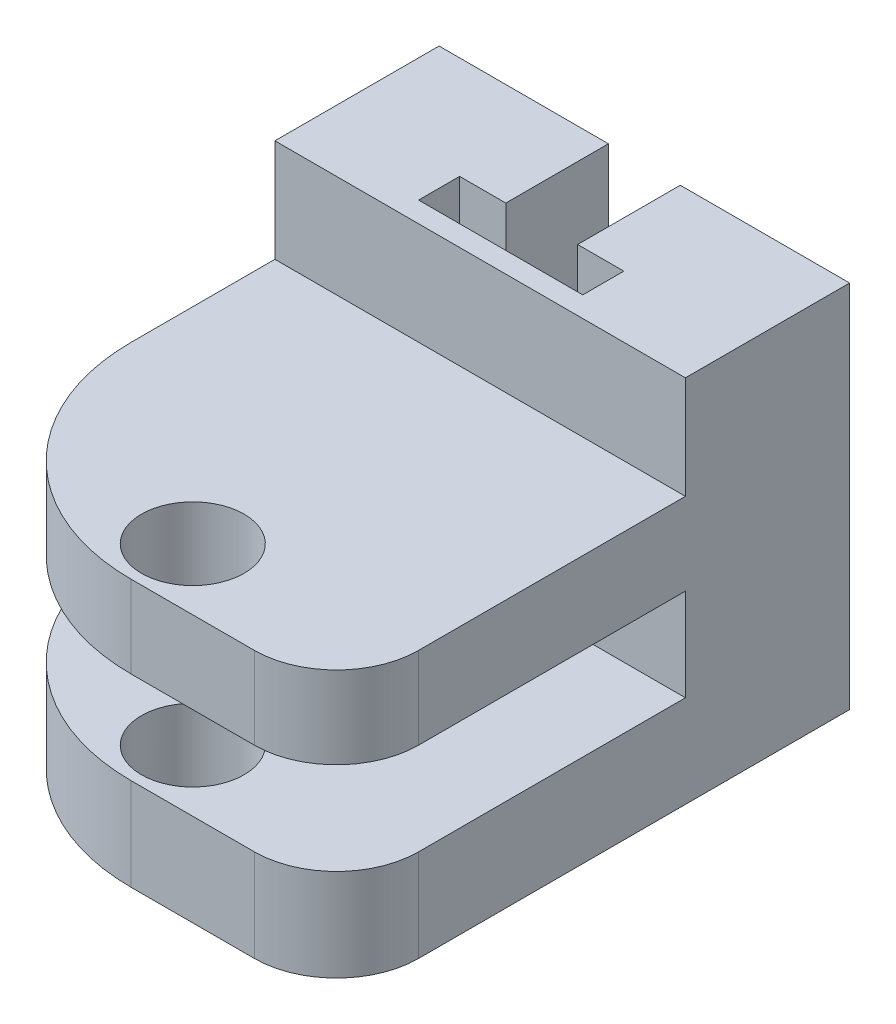
ISO-10303-21;
HEADER;
FILE_DESCRIPTION(('STEP AP214'),'2;1');
FILE_NAME('part.step','',(''),(''),'','','');
FILE_SCHEMA(('AUTOMOTIVE_DESIGN { 1 0 10303 214 1 1 1 1 }'));
ENDSEC;
DATA;
#1=APPLICATION_CONTEXT('core data for automotive mechanical design processes');
#2=APPLICATION_PROTOCOL_DEFINITION('international standard','automotive_design',2000,#1);
#3=PRODUCT_CONTEXT('',#1,'mechanical');
#4=PRODUCT('Part','Part','',(#3));
#5=PRODUCT_RELATED_PRODUCT_CATEGORY('part','',(#4));
#6=PRODUCT_DEFINITION_FORMATION('','',#4);
#7=PRODUCT_DEFINITION_CONTEXT('part definition',#1,'design');
#8=PRODUCT_DEFINITION('design','',#6,#7);
#9=PRODUCT_DEFINITION_SHAPE('','',#8);
#10=(LENGTH_UNIT() NAMED_UNIT(*) SI_UNIT(.MILLI.,.METRE.));
#11=(NAMED_UNIT(*) PLANE_ANGLE_UNIT() SI_UNIT($,.RADIAN.));
#12=(NAMED_UNIT(*) SI_UNIT($,.STERADIAN.) SOLID_ANGLE_UNIT());
#13=UNCERTAINTY_MEASURE_WITH_UNIT(LENGTH_MEASURE(1.E-05),#10,'distance_accuracy_value','');
#14=(GEOMETRIC_REPRESENTATION_CONTEXT(3) GLOBAL_UNCERTAINTY_ASSIGNED_CONTEXT((#13)) GLOBAL_UNIT_ASSIGNED_CONTEXT((#10,
#11,#12)) REPRESENTATION_CONTEXT('',''));
#15=CARTESIAN_POINT('',(0.,0.,0.));
#16=DIRECTION('',(0.,0.,1.));
#17=DIRECTION('',(1.,0.,0.));
#18=AXIS2_PLACEMENT_3D('',#15,#16,#17);
#19=CARTESIAN_POINT('',(0.247080795987481,3.,10.5748161790375));
#20=DIRECTION('',(0.,-1.,0.));
#21=DIRECTION('',(0.,0.,-1.));
#22=AXIS2_PLACEMENT_3D('',#19,#20,#21);
#23=CYLINDRICAL_SURFACE('',#22,10.);
#24=CARTESIAN_POINT('',(0.247080795987481,9.,10.5748161790375));
#25=DIRECTION('',(0.,-1.,0.));
#26=DIRECTION('',(0.,0.,-1.));
#27=AXIS2_PLACEMENT_3D('',#24,#25,#26);
#28=CIRCLE('',#27,10.);
#29=CARTESIAN_POINT('',(0.247080795987481,9.,20.5748161790375));
#30=VERTEX_POINT('',#29);
#31=CARTESIAN_POINT('',(-9.75291920401252,9.,10.5748161790375));
#32=VERTEX_POINT('',#31);
#33=EDGE_CURVE('E282',#30,#32,#28,.T.);
#34=ORIENTED_EDGE('',*,*,#33,.F.);
#35=DIRECTION('',(0.,-1.,0.));
#36=VECTOR('',#35,1.);
#37=CARTESIAN_POINT('',(0.247080795987481,3.,20.5748161790375));
#38=LINE('',#37,#36);
#39=CARTESIAN_POINT('',(0.247080795987481,13.,20.5748161790375));
#40=VERTEX_POINT('',#39);
#41=EDGE_CURVE('E414',#40,#30,#38,.T.);
#42=ORIENTED_EDGE('',*,*,#41,.F.);
#43=CARTESIAN_POINT('',(0.247080795987481,13.,10.5748161790375));
#44=DIRECTION('',(0.,-1.,0.));
#45=DIRECTION('',(0.,0.,-1.));
#46=AXIS2_PLACEMENT_3D('',#43,#44,#45);
#47=CIRCLE('',#46,10.);
#48=CARTESIAN_POINT('',(-9.75291920401252,13.,10.5748161790375));
#49=VERTEX_POINT('',#48);
#50=EDGE_CURVE('E313',#40,#49,#47,.T.);
#51=ORIENTED_EDGE('',*,*,#50,.T.);
#52=DIRECTION('',(0.,-1.,0.));
#53=VECTOR('',#52,1.);
#54=CARTESIAN_POINT('',(-9.75291920401252,3.,10.5748161790375));
#55=LINE('',#54,#53);
#56=EDGE_CURVE('E419',#49,#32,#55,.T.);
#57=ORIENTED_EDGE('',*,*,#56,.T.);
#58=EDGE_LOOP('',(#34,#42,#51,#57));
#59=FACE_BOUND('',#58,.T.);
#60=ADVANCED_FACE('F43',(#59),#23,.T.);
#61=CARTESIAN_POINT('',(0.247080795987481,3.,20.5748161790375));
#62=DIRECTION('',(0.,0.,-1.));
#63=DIRECTION('',(-1.,0.,0.));
#64=AXIS2_PLACEMENT_3D('',#61,#62,#63);
#65=PLANE('',#64);
#66=DIRECTION('',(1.,0.,0.));
#67=VECTOR('',#66,1.);
#68=CARTESIAN_POINT('',(-9.75291920401252,9.,20.5748161790375));
#69=LINE('',#68,#67);
#70=CARTESIAN_POINT('',(6.24708079598748,9.,20.5748161790375));
#71=VERTEX_POINT('',#70);
#72=EDGE_CURVE('E244',#30,#71,#69,.T.);
#73=ORIENTED_EDGE('',*,*,#72,.T.);
#74=DIRECTION('',(0.,-1.,0.));
#75=VECTOR('',#74,1.);
#76=CARTESIAN_POINT('',(6.24708079598748,3.,20.5748161790375));
#77=LINE('',#76,#75);
#78=CARTESIAN_POINT('',(6.24708079598748,13.,20.5748161790375));
#79=VERTEX_POINT('',#78);
#80=EDGE_CURVE('E434',#71,#79,#77,.F.);
#81=ORIENTED_EDGE('',*,*,#80,.T.);
#82=DIRECTION('',(-1.,0.,0.));
#83=VECTOR('',#82,1.);
#84=CARTESIAN_POINT('',(0.247080795987481,13.,20.5748161790375));
#85=LINE('',#84,#83);
#86=EDGE_CURVE('E309',#79,#40,#85,.T.);
#87=ORIENTED_EDGE('',*,*,#86,.T.);
#88=ORIENTED_EDGE('',*,*,#41,.T.);
#89=EDGE_LOOP('',(#73,#81,#87,#88));
#90=FACE_BOUND('',#89,.T.);
#91=ADVANCED_FACE('F455',(#90),#65,.F.);
#92=CARTESIAN_POINT('',(0.247080795987481,3.,17.5748161790375));
#93=DIRECTION('',(0.,-1.,0.));
#94=DIRECTION('',(0.,0.,-1.));
#95=AXIS2_PLACEMENT_3D('',#92,#93,#94);
#96=CYLINDRICAL_SURFACE('',#95,2.5);
#97=CARTESIAN_POINT('',(0.247080795987481,13.,17.5748161790375));
#98=DIRECTION('',(0.,-1.,0.));
#99=DIRECTION('',(0.,0.,-1.));
#100=AXIS2_PLACEMENT_3D('',#97,#98,#99);
#101=CIRCLE('',#100,2.5);
#102=CARTESIAN_POINT('',(0.247080795987481,13.,15.0748161790375));
#103=VERTEX_POINT('',#102);
#104=EDGE_CURVE('E293',#103,#103,#101,.T.);
#105=ORIENTED_EDGE('',*,*,#104,.F.);
#106=EDGE_LOOP('',(#105));
#107=FACE_BOUND('',#106,.T.);
#108=CARTESIAN_POINT('',(0.247080795987481,9.,17.5748161790375));
#109=DIRECTION('',(0.,-1.,0.));
#110=DIRECTION('',(0.,0.,-1.));
#111=AXIS2_PLACEMENT_3D('',#108,#109,#110);
#112=CIRCLE('',#111,2.5);
#113=CARTESIAN_POINT('',(0.247080795987481,9.,15.0748161790375));
#114=VERTEX_POINT('',#113);
#115=EDGE_CURVE('E278',#114,#114,#112,.T.);
#116=ORIENTED_EDGE('',*,*,#115,.T.);
#117=EDGE_LOOP('',(#116));
#118=FACE_BOUND('',#117,.T.);
#119=ADVANCED_FACE('F514',(#107,#118),#96,.F.);
#120=CARTESIAN_POINT('',(6.24708079598748,3.,16.5748161790375));
#121=DIRECTION('',(0.,-1.,0.));
#122=DIRECTION('',(0.,0.,-1.));
#123=AXIS2_PLACEMENT_3D('',#120,#121,#122);
#124=CYLINDRICAL_SURFACE('',#123,4.);
#125=ORIENTED_EDGE('',*,*,#80,.F.);
#126=CARTESIAN_POINT('',(6.24708079598748,9.,16.5748161790375));
#127=DIRECTION('',(0.,-1.,0.));
#128=DIRECTION('',(0.,0.,-1.));
#129=AXIS2_PLACEMENT_3D('',#126,#127,#128);
#130=CIRCLE('',#129,4.);
#131=CARTESIAN_POINT('',(10.2470807959875,9.,16.5748161790375));
#132=VERTEX_POINT('',#131);
#133=EDGE_CURVE('E52',#71,#132,#130,.F.);
#134=ORIENTED_EDGE('',*,*,#133,.T.);
#135=DIRECTION('',(0.,-1.,0.));
#136=VECTOR('',#135,1.);
#137=CARTESIAN_POINT('',(10.2470807959875,3.,16.5748161790375));
#138=LINE('',#137,#136);
#139=CARTESIAN_POINT('',(10.2470807959875,13.,16.5748161790375));
#140=VERTEX_POINT('',#139);
#141=EDGE_CURVE('E427',#140,#132,#138,.T.);
#142=ORIENTED_EDGE('',*,*,#141,.F.);
#143=CARTESIAN_POINT('',(6.24708079598748,13.,16.5748161790375));
#144=DIRECTION('',(0.,-1.,0.));
#145=DIRECTION('',(0.,0.,-1.));
#146=AXIS2_PLACEMENT_3D('',#143,#144,#145);
#147=CIRCLE('',#146,4.);
#148=EDGE_CURVE('E305',#140,#79,#147,.T.);
#149=ORIENTED_EDGE('',*,*,#148,.T.);
#150=EDGE_LOOP('',(#125,#134,#142,#149));
#151=FACE_BOUND('',#150,.T.);
#152=ADVANCED_FACE('F443',(#151),#124,.T.);
#153=CARTESIAN_POINT('',(1.99708079598748,3.,0.574816179037526));
#154=DIRECTION('',(1.,0.,0.));
#155=DIRECTION('',(0.,0.,-1.));
#156=AXIS2_PLACEMENT_3D('',#153,#154,#155);
#157=PLANE('',#156);
#158=DIRECTION('',(0.,-1.,0.));
#159=VECTOR('',#158,1.);
#160=CARTESIAN_POINT('',(1.99708079598748,3.,-4.42518382096247));
#161=LINE('',#160,#159);
#162=CARTESIAN_POINT('',(1.99708079598748,18.,-4.42518382096247));
#163=VERTEX_POINT('',#162);
#164=CARTESIAN_POINT('',(1.99708079598748,6.5,-4.42518382096247));
#165=VERTEX_POINT('',#164);
#166=EDGE_CURVE('E407',#163,#165,#161,.T.);
#167=ORIENTED_EDGE('',*,*,#166,.T.);
#168=DIRECTION('',(0.,0.,-1.));
#169=VECTOR('',#168,1.);
#170=CARTESIAN_POINT('',(1.99708079598748,6.5,0.574816179037526));
#171=LINE('',#170,#169);
#172=CARTESIAN_POINT('',(1.99708079598748,6.5,0.574816179037526));
#173=VERTEX_POINT('',#172);
#174=EDGE_CURVE('E220',#173,#165,#171,.T.);
#175=ORIENTED_EDGE('',*,*,#174,.F.);
#176=DIRECTION('',(0.,-1.,0.));
#177=VECTOR('',#176,1.);
#178=CARTESIAN_POINT('',(1.99708079598748,3.,0.574816179037526));
#179=LINE('',#178,#177);
#180=CARTESIAN_POINT('',(1.99708079598748,18.,0.574816179037526));
#181=VERTEX_POINT('',#180);
#182=EDGE_CURVE('E404',#181,#173,#179,.T.);
#183=ORIENTED_EDGE('',*,*,#182,.F.);
#184=DIRECTION('',(0.,0.,1.));
#185=VECTOR('',#184,1.);
#186=CARTESIAN_POINT('',(1.99708079598748,18.,-4.42518382096247));
#187=LINE('',#186,#185);
#188=EDGE_CURVE('E332',#163,#181,#187,.T.);
#189=ORIENTED_EDGE('',*,*,#188,.F.);
#190=EDGE_LOOP('',(#167,#175,#183,#189));
#191=FACE_BOUND('',#190,.T.);
#192=ADVANCED_FACE('F582',(#191),#157,.F.);
#193=CARTESIAN_POINT('',(4.24708079598748,3.,0.574816179037526));
#194=DIRECTION('',(0.,0.,-1.));
#195=DIRECTION('',(-1.,0.,0.));
#196=AXIS2_PLACEMENT_3D('',#193,#194,#195);
#197=PLANE('',#196);
#198=ORIENTED_EDGE('',*,*,#182,.T.);
#199=DIRECTION('',(-1.,0.,0.));
#200=VECTOR('',#199,1.);
#201=CARTESIAN_POINT('',(4.24708079598748,6.5,0.574816179037526));
#202=LINE('',#201,#200);
#203=CARTESIAN_POINT('',(4.24708079598748,6.5,0.574816179037526));
#204=VERTEX_POINT('',#203);
#205=EDGE_CURVE('E238',#204,#173,#202,.T.);
#206=ORIENTED_EDGE('',*,*,#205,.F.);
#207=DIRECTION('',(0.,-1.,0.));
#208=VECTOR('',#207,1.);
#209=CARTESIAN_POINT('',(4.24708079598748,3.,0.574816179037526));
#210=LINE('',#209,#208);
#211=CARTESIAN_POINT('',(4.24708079598748,18.,0.574816179037526));
#212=VERTEX_POINT('',#211);
#213=EDGE_CURVE('E401',#212,#204,#210,.T.);
#214=ORIENTED_EDGE('',*,*,#213,.F.);
#215=DIRECTION('',(1.,0.,0.));
#216=VECTOR('',#215,1.);
#217=CARTESIAN_POINT('',(1.99708079598748,18.,0.574816179037526));
#218=LINE('',#217,#216);
#219=EDGE_CURVE('E336',#181,#212,#218,.T.);
#220=ORIENTED_EDGE('',*,*,#219,.F.);
#221=EDGE_LOOP('',(#198,#206,#214,#220));
#222=FACE_BOUND('',#221,.T.);
#223=ADVANCED_FACE('F590',(#222),#197,.F.);
#224=CARTESIAN_POINT('',(4.24708079598748,3.,2.57481617903753));
#225=DIRECTION('',(1.,0.,0.));
#226=DIRECTION('',(0.,0.,-1.));
#227=AXIS2_PLACEMENT_3D('',#224,#225,#226);
#228=PLANE('',#227);
#229=ORIENTED_EDGE('',*,*,#213,.T.);
#230=DIRECTION('',(0.,0.,-1.));
#231=VECTOR('',#230,1.);
#232=CARTESIAN_POINT('',(4.24708079598748,6.5,2.57481617903753));
#233=LINE('',#232,#231);
#234=CARTESIAN_POINT('',(4.24708079598748,6.5,2.57481617903753));
#235=VERTEX_POINT('',#234);
#236=EDGE_CURVE('E234',#235,#204,#233,.T.);
#237=ORIENTED_EDGE('',*,*,#236,.F.);
#238=DIRECTION('',(0.,-1.,0.));
#239=VECTOR('',#238,1.);
#240=CARTESIAN_POINT('',(4.24708079598748,3.,2.57481617903753));
#241=LINE('',#240,#239);
#242=CARTESIAN_POINT('',(4.24708079598748,18.,2.57481617903753));
#243=VERTEX_POINT('',#242);
#244=EDGE_CURVE('E398',#243,#235,#241,.T.);
#245=ORIENTED_EDGE('',*,*,#244,.F.);
#246=DIRECTION('',(0.,0.,1.));
#247=VECTOR('',#246,1.);
#248=CARTESIAN_POINT('',(4.24708079598748,18.,0.574816179037526));
#249=LINE('',#248,#247);
#250=EDGE_CURVE('E340',#212,#243,#249,.T.);
#251=ORIENTED_EDGE('',*,*,#250,.F.);
#252=EDGE_LOOP('',(#229,#237,#245,#251));
#253=FACE_BOUND('',#252,.T.);
#254=ADVANCED_FACE('F599',(#253),#228,.F.);
#255=CARTESIAN_POINT('',(-3.75291920401252,3.,2.57481617903753));
#256=DIRECTION('',(0.,0.,1.));
#257=DIRECTION('',(1.,0.,0.));
#258=AXIS2_PLACEMENT_3D('',#255,#256,#257);
#259=PLANE('',#258);
#260=ORIENTED_EDGE('',*,*,#244,.T.);
#261=DIRECTION('',(1.,0.,0.));
#262=VECTOR('',#261,1.);
#263=CARTESIAN_POINT('',(-3.75291920401252,6.5,2.57481617903753));
#264=LINE('',#263,#262);
#265=CARTESIAN_POINT('',(-3.75291920401252,6.5,2.57481617903753));
#266=VERTEX_POINT('',#265);
#267=EDGE_CURVE('E230',#266,#235,#264,.T.);
#268=ORIENTED_EDGE('',*,*,#267,.F.);
#269=DIRECTION('',(0.,-1.,0.));
#270=VECTOR('',#269,1.);
#271=CARTESIAN_POINT('',(-3.75291920401252,3.,2.57481617903753));
#272=LINE('',#271,#270);
#273=CARTESIAN_POINT('',(-3.75291920401252,18.,2.57481617903753));
#274=VERTEX_POINT('',#273);
#275=EDGE_CURVE('E395',#274,#266,#272,.T.);
#276=ORIENTED_EDGE('',*,*,#275,.F.);
#277=DIRECTION('',(-1.,0.,0.));
#278=VECTOR('',#277,1.);
#279=CARTESIAN_POINT('',(4.24708079598748,18.,2.57481617903753));
#280=LINE('',#279,#278);
#281=EDGE_CURVE('E344',#243,#274,#280,.T.);
#282=ORIENTED_EDGE('',*,*,#281,.F.);
#283=EDGE_LOOP('',(#260,#268,#276,#282));
#284=FACE_BOUND('',#283,.T.);
#285=ADVANCED_FACE('F607',(#284),#259,.F.);
#286=CARTESIAN_POINT('',(-3.75291920401252,3.,0.574816179037526));
#287=DIRECTION('',(-1.,0.,0.));
#288=DIRECTION('',(0.,0.,1.));
#289=AXIS2_PLACEMENT_3D('',#286,#287,#288);
#290=PLANE('',#289);
#291=ORIENTED_EDGE('',*,*,#275,.T.);
#292=DIRECTION('',(0.,0.,1.));
#293=VECTOR('',#292,1.);
#294=CARTESIAN_POINT('',(-3.75291920401252,6.5,0.574816179037526));
#295=LINE('',#294,#293);
#296=CARTESIAN_POINT('',(-3.75291920401252,6.5,0.574816179037526));
#297=VERTEX_POINT('',#296);
#298=EDGE_CURVE('E226',#297,#266,#295,.T.);
#299=ORIENTED_EDGE('',*,*,#298,.F.);
#300=DIRECTION('',(0.,-1.,0.));
#301=VECTOR('',#300,1.);
#302=CARTESIAN_POINT('',(-3.75291920401252,3.,0.574816179037526));
#303=LINE('',#302,#301);
#304=CARTESIAN_POINT('',(-3.75291920401252,18.,0.574816179037526));
#305=VERTEX_POINT('',#304);
#306=EDGE_CURVE('E392',#305,#297,#303,.T.);
#307=ORIENTED_EDGE('',*,*,#306,.F.);
#308=DIRECTION('',(0.,0.,-1.));
#309=VECTOR('',#308,1.);
#310=CARTESIAN_POINT('',(-3.75291920401252,18.,2.57481617903753));
#311=LINE('',#310,#309);
#312=EDGE_CURVE('E348',#274,#305,#311,.T.);
#313=ORIENTED_EDGE('',*,*,#312,.F.);
#314=EDGE_LOOP('',(#291,#299,#307,#313));
#315=FACE_BOUND('',#314,.T.);
#316=ADVANCED_FACE('F615',(#315),#290,.F.);
#317=CARTESIAN_POINT('',(-1.50291920401252,3.,0.574816179037526));
#318=DIRECTION('',(0.,0.,-1.));
#319=DIRECTION('',(-1.,0.,0.));
#320=AXIS2_PLACEMENT_3D('',#317,#318,#319);
#321=PLANE('',#320);
#322=ORIENTED_EDGE('',*,*,#306,.T.);
#323=DIRECTION('',(-1.,0.,0.));
#324=VECTOR('',#323,1.);
#325=CARTESIAN_POINT('',(-1.50291920401252,6.5,0.574816179037527));
#326=LINE('',#325,#324);
#327=CARTESIAN_POINT('',(-1.50291920401252,6.5,0.574816179037527));
#328=VERTEX_POINT('',#327);
#329=EDGE_CURVE('E214',#328,#297,#326,.T.);
#330=ORIENTED_EDGE('',*,*,#329,.F.);
#331=DIRECTION('',(0.,-1.,0.));
#332=VECTOR('',#331,1.);
#333=CARTESIAN_POINT('',(-1.50291920401252,3.,0.574816179037526));
#334=LINE('',#333,#332);
#335=CARTESIAN_POINT('',(-1.50291920401252,18.,0.574816179037526));
#336=VERTEX_POINT('',#335);
#337=EDGE_CURVE('E204',#336,#328,#334,.T.);
#338=ORIENTED_EDGE('',*,*,#337,.F.);
#339=DIRECTION('',(1.,0.,0.));
#340=VECTOR('',#339,1.);
#341=CARTESIAN_POINT('',(-3.75291920401252,18.,0.574816179037526));
#342=LINE('',#341,#340);
#343=EDGE_CURVE('E352',#305,#336,#342,.T.);
#344=ORIENTED_EDGE('',*,*,#343,.F.);
#345=EDGE_LOOP('',(#322,#330,#338,#344));
#346=FACE_BOUND('',#345,.T.);
#347=ADVANCED_FACE('F504',(#346),#321,.F.);
#348=CARTESIAN_POINT('',(-1.50291920401252,3.,-4.42518382096247));
#349=DIRECTION('',(-1.,0.,0.));
#350=DIRECTION('',(0.,0.,1.));
#351=AXIS2_PLACEMENT_3D('',#348,#349,#350);
#352=PLANE('',#351);
#353=ORIENTED_EDGE('',*,*,#337,.T.);
#354=DIRECTION('',(0.,0.,1.));
#355=VECTOR('',#354,1.);
#356=CARTESIAN_POINT('',(-1.50291920401252,6.5,-4.42518382096247));
#357=LINE('',#356,#355);
#358=CARTESIAN_POINT('',(-1.50291920401252,6.5,-4.42518382096247));
#359=VERTEX_POINT('',#358);
#360=EDGE_CURVE('E208',#359,#328,#357,.T.);
#361=ORIENTED_EDGE('',*,*,#360,.F.);
#362=DIRECTION('',(0.,-1.,0.));
#363=VECTOR('',#362,1.);
#364=CARTESIAN_POINT('',(-1.50291920401252,3.,-4.42518382096247));
#365=LINE('',#364,#363);
#366=CARTESIAN_POINT('',(-1.50291920401252,18.,-4.42518382096247));
#367=VERTEX_POINT('',#366);
#368=EDGE_CURVE('E193',#367,#359,#365,.T.);
#369=ORIENTED_EDGE('',*,*,#368,.F.);
#370=DIRECTION('',(0.,0.,-1.));
#371=VECTOR('',#370,1.);
#372=CARTESIAN_POINT('',(-1.50291920401252,18.,0.574816179037526));
#373=LINE('',#372,#371);
#374=EDGE_CURVE('E356',#336,#367,#373,.T.);
#375=ORIENTED_EDGE('',*,*,#374,.F.);
#376=EDGE_LOOP('',(#353,#361,#369,#375));
#377=FACE_BOUND('',#376,.T.);
#378=ADVANCED_FACE('F209',(#377),#352,.F.);
#379=CARTESIAN_POINT('',(-9.75291920401252,18.,3.57481617903752));
#380=DIRECTION('',(0.,0.,-1.));
#381=DIRECTION('',(-1.,0.,0.));
#382=AXIS2_PLACEMENT_3D('',#379,#380,#381);
#383=PLANE('',#382);
#384=DIRECTION('',(-1.,0.,0.));
#385=VECTOR('',#384,1.);
#386=CARTESIAN_POINT('',(-9.75291920401252,13.,3.57481617903752));
#387=LINE('',#386,#385);
#388=CARTESIAN_POINT('',(10.2470807959875,13.,3.57481617903752));
#389=VERTEX_POINT('',#388);
#390=CARTESIAN_POINT('',(-9.75291920401252,13.,3.57481617903752));
#391=VERTEX_POINT('',#390);
#392=EDGE_CURVE('E67',#389,#391,#387,.T.);
#393=ORIENTED_EDGE('',*,*,#392,.F.);
#394=DIRECTION('',(0.,-1.,0.));
#395=VECTOR('',#394,1.);
#396=CARTESIAN_POINT('',(10.2470807959875,18.,3.57481617903752));
#397=LINE('',#396,#395);
#398=CARTESIAN_POINT('',(10.2470807959875,18.,3.57481617903752));
#399=VERTEX_POINT('',#398);
#400=EDGE_CURVE('E361',#399,#389,#397,.T.);
#401=ORIENTED_EDGE('',*,*,#400,.F.);
#402=DIRECTION('',(1.,0.,0.));
#403=VECTOR('',#402,1.);
#404=CARTESIAN_POINT('',(-9.75291920401252,18.,3.57481617903752));
#405=LINE('',#404,#403);
#406=CARTESIAN_POINT('',(-9.75291920401252,18.,3.57481617903752));
#407=VERTEX_POINT('',#406);
#408=EDGE_CURVE('E321',#407,#399,#405,.T.);
#409=ORIENTED_EDGE('',*,*,#408,.F.);
#410=DIRECTION('',(0.,-1.,0.));
#411=VECTOR('',#410,1.);
#412=CARTESIAN_POINT('',(-9.75291920401252,18.,3.57481617903752));
#413=LINE('',#412,#411);
#414=EDGE_CURVE('E364',#407,#391,#413,.T.);
#415=ORIENTED_EDGE('',*,*,#414,.T.);
#416=EDGE_LOOP('',(#393,#401,#409,#415));
#417=FACE_BOUND('',#416,.T.);
#418=ADVANCED_FACE('F496',(#417),#383,.F.);
#419=CARTESIAN_POINT('',(0.247080795987481,0.,10.5748161790375));
#420=DIRECTION('',(0.,1.,0.));
#421=DIRECTION('',(0.,0.,1.));
#422=AXIS2_PLACEMENT_3D('',#419,#420,#421);
#423=PLANE('',#422);
#424=DIRECTION('',(0.,0.,1.));
#425=VECTOR('',#424,1.);
#426=CARTESIAN_POINT('',(-9.75291920401252,0.,10.5748161790375));
#427=LINE('',#426,#425);
#428=CARTESIAN_POINT('',(-9.75291920401252,0.,-4.42518382096247));
#429=VERTEX_POINT('',#428);
#430=CARTESIAN_POINT('',(-9.75291920401252,0.,10.5748161790375));
#431=VERTEX_POINT('',#430);
#432=EDGE_CURVE('E371',#429,#431,#427,.T.);
#433=ORIENTED_EDGE('',*,*,#432,.F.);
#434=DIRECTION('',(-1.,0.,0.));
#435=VECTOR('',#434,1.);
#436=CARTESIAN_POINT('',(1.99708079598748,0.,-4.42518382096247));
#437=LINE('',#436,#435);
#438=CARTESIAN_POINT('',(10.2470807959875,0.,-4.42518382096247));
#439=VERTEX_POINT('',#438);
#440=EDGE_CURVE('E205',#439,#429,#437,.T.);
#441=ORIENTED_EDGE('',*,*,#440,.F.);
#442=DIRECTION('',(0.,0.,-1.));
#443=VECTOR('',#442,1.);
#444=CARTESIAN_POINT('',(10.2470807959875,0.,-4.42518382096247));
#445=LINE('',#444,#443);
#446=CARTESIAN_POINT('',(10.2470807959875,0.,16.5748161790375));
#447=VERTEX_POINT('',#446);
#448=EDGE_CURVE('E383',#447,#439,#445,.T.);
#449=ORIENTED_EDGE('',*,*,#448,.F.);
#450=CARTESIAN_POINT('',(6.24708079598748,0.,16.5748161790375));
#451=DIRECTION('',(0.,1.,0.));
#452=DIRECTION('',(0.,0.,1.));
#453=AXIS2_PLACEMENT_3D('',#450,#451,#452);
#454=CIRCLE('',#453,4.);
#455=CARTESIAN_POINT('',(6.24708079598748,0.,20.5748161790375));
#456=VERTEX_POINT('',#455);
#457=EDGE_CURVE('E431',#447,#456,#454,.F.);
#458=ORIENTED_EDGE('',*,*,#457,.T.);
#459=DIRECTION('',(1.,0.,0.));
#460=VECTOR('',#459,1.);
#461=CARTESIAN_POINT('',(0.247080795987481,0.,20.5748161790375));
#462=LINE('',#461,#460);
#463=CARTESIAN_POINT('',(0.247080795987481,0.,20.5748161790375));
#464=VERTEX_POINT('',#463);
#465=EDGE_CURVE('E379',#464,#456,#462,.T.);
#466=ORIENTED_EDGE('',*,*,#465,.F.);
#467=CARTESIAN_POINT('',(0.247080795987481,0.,10.5748161790375));
#468=DIRECTION('',(0.,1.,0.));
#469=DIRECTION('',(0.,0.,1.));
#470=AXIS2_PLACEMENT_3D('',#467,#468,#469);
#471=CIRCLE('',#470,10.);
#472=EDGE_CURVE('E375',#431,#464,#471,.T.);
#473=ORIENTED_EDGE('',*,*,#472,.F.);
#474=EDGE_LOOP('',(#433,#441,#449,#458,#466,#473));
#475=FACE_BOUND('',#474,.T.);
#476=CARTESIAN_POINT('',(0.247080795987481,0.,17.5748161790375));
#477=DIRECTION('',(0.,1.,0.));
#478=DIRECTION('',(0.,0.,1.));
#479=AXIS2_PLACEMENT_3D('',#476,#477,#478);
#480=CIRCLE('',#479,2.5);
#481=CARTESIAN_POINT('',(0.247080795987481,0.,20.0748161790375));
#482=VERTEX_POINT('',#481);
#483=EDGE_CURVE('E367',#482,#482,#480,.T.);
#484=ORIENTED_EDGE('',*,*,#483,.T.);
#485=EDGE_LOOP('',(#484));
#486=FACE_BOUND('',#485,.T.);
#487=ADVANCED_FACE('F472',(#475,#486),#423,.F.);
#488=CARTESIAN_POINT('',(-9.75291920401252,3.,10.5748161790375));
#489=DIRECTION('',(1.,0.,0.));
#490=DIRECTION('',(0.,0.,-1.));
#491=AXIS2_PLACEMENT_3D('',#488,#489,#490);
#492=PLANE('',#491);
#493=CARTESIAN_POINT('',(-9.75291920401252,4.5,10.5748161790375));
#494=VERTEX_POINT('',#493);
#495=EDGE_CURVE('E418',#494,#431,#55,.T.);
#496=ORIENTED_EDGE('',*,*,#495,.F.);
#497=DIRECTION('',(0.,0.,1.));
#498=VECTOR('',#497,1.);
#499=CARTESIAN_POINT('',(-9.75291920401252,4.5,-16.9251838209625));
#500=LINE('',#499,#498);
#501=CARTESIAN_POINT('',(-9.75291920401252,4.5,3.57481617903752));
#502=VERTEX_POINT('',#501);
#503=EDGE_CURVE('E262',#502,#494,#500,.T.);
#504=ORIENTED_EDGE('',*,*,#503,.F.);
#505=DIRECTION('',(0.,-1.,0.));
#506=VECTOR('',#505,1.);
#507=CARTESIAN_POINT('',(-9.75291920401252,9.,3.57481617903752));
#508=LINE('',#507,#506);
#509=CARTESIAN_POINT('',(-9.75291920401252,9.,3.57481617903752));
#510=VERTEX_POINT('',#509);
#511=EDGE_CURVE('E248',#510,#502,#508,.T.);
#512=ORIENTED_EDGE('',*,*,#511,.F.);
#513=DIRECTION('',(0.,0.,1.));
#514=VECTOR('',#513,1.);
#515=CARTESIAN_POINT('',(-9.75291920401252,9.,-16.9251838209625));
#516=LINE('',#515,#514);
#517=EDGE_CURVE('E249',#510,#32,#516,.T.);
#518=ORIENTED_EDGE('',*,*,#517,.T.);
#519=ORIENTED_EDGE('',*,*,#56,.F.);
#520=DIRECTION('',(0.,0.,-1.));
#521=VECTOR('',#520,1.);
#522=CARTESIAN_POINT('',(-9.75291920401252,13.,-4.42518382096247));
#523=LINE('',#522,#521);
#524=EDGE_CURVE('E297',#49,#391,#523,.T.);
#525=ORIENTED_EDGE('',*,*,#524,.T.);
#526=ORIENTED_EDGE('',*,*,#414,.F.);
#527=DIRECTION('',(0.,0.,1.));
#528=VECTOR('',#527,1.);
#529=CARTESIAN_POINT('',(-9.75291920401252,18.,-4.42518382096247));
#530=LINE('',#529,#528);
#531=CARTESIAN_POINT('',(-9.75291920401252,18.,-4.42518382096247));
#532=VERTEX_POINT('',#531);
#533=EDGE_CURVE('E317',#532,#407,#530,.T.);
#534=ORIENTED_EDGE('',*,*,#533,.F.);
#535=DIRECTION('',(0.,-1.,0.));
#536=VECTOR('',#535,1.);
#537=CARTESIAN_POINT('',(-9.75291920401252,3.,-4.42518382096247));
#538=LINE('',#537,#536);
#539=EDGE_CURVE('E423',#532,#429,#538,.T.);
#540=ORIENTED_EDGE('',*,*,#539,.T.);
#541=ORIENTED_EDGE('',*,*,#432,.T.);
#542=EDGE_LOOP('',(#496,#504,#512,#518,#519,#525,#526,#534,#540,#541));
#543=FACE_BOUND('',#542,.T.);
#544=ADVANCED_FACE('F489',(#543),#492,.F.);
#545=CARTESIAN_POINT('',(0.247080795987481,4.5,20.5748161790375));
#546=VERTEX_POINT('',#545);
#547=EDGE_CURVE('E413',#546,#464,#38,.T.);
#548=ORIENTED_EDGE('',*,*,#547,.F.);
#549=CARTESIAN_POINT('',(0.247080795987481,4.5,10.5748161790375));
#550=DIRECTION('',(0.,-1.,0.));
#551=DIRECTION('',(1.,0.,0.));
#552=AXIS2_PLACEMENT_3D('',#549,#550,#551);
#553=CIRCLE('',#552,10.);
#554=EDGE_CURVE('E289',#546,#494,#553,.T.);
#555=ORIENTED_EDGE('',*,*,#554,.T.);
#556=ORIENTED_EDGE('',*,*,#495,.T.);
#557=ORIENTED_EDGE('',*,*,#472,.T.);
#558=EDGE_LOOP('',(#548,#555,#556,#557));
#559=FACE_BOUND('',#558,.T.);
#560=ADVANCED_FACE('F468',(#559),#23,.T.);
#561=CARTESIAN_POINT('',(6.24708079598748,4.5,20.5748161790375));
#562=VERTEX_POINT('',#561);
#563=EDGE_CURVE('E435',#456,#562,#77,.F.);
#564=ORIENTED_EDGE('',*,*,#563,.T.);
#565=DIRECTION('',(1.,0.,0.));
#566=VECTOR('',#565,1.);
#567=CARTESIAN_POINT('',(-9.75291920401252,4.5,20.5748161790375));
#568=LINE('',#567,#566);
#569=EDGE_CURVE('E250',#546,#562,#568,.T.);
#570=ORIENTED_EDGE('',*,*,#569,.F.);
#571=ORIENTED_EDGE('',*,*,#547,.T.);
#572=ORIENTED_EDGE('',*,*,#465,.T.);
#573=EDGE_LOOP('',(#564,#570,#571,#572));
#574=FACE_BOUND('',#573,.T.);
#575=ADVANCED_FACE('F463',(#574),#65,.F.);
#576=CARTESIAN_POINT('',(10.2470807959875,3.,-4.42518382096247));
#577=DIRECTION('',(-1.,0.,0.));
#578=DIRECTION('',(0.,0.,1.));
#579=AXIS2_PLACEMENT_3D('',#576,#577,#578);
#580=PLANE('',#579);
#581=DIRECTION('',(0.,-1.,0.));
#582=VECTOR('',#581,1.);
#583=CARTESIAN_POINT('',(10.2470807959875,9.,3.57481617903752));
#584=LINE('',#583,#582);
#585=CARTESIAN_POINT('',(10.2470807959875,9.,3.57481617903752));
#586=VERTEX_POINT('',#585);
#587=CARTESIAN_POINT('',(10.2470807959875,4.5,3.57481617903752));
#588=VERTEX_POINT('',#587);
#589=EDGE_CURVE('E254',#586,#588,#584,.T.);
#590=ORIENTED_EDGE('',*,*,#589,.T.);
#591=DIRECTION('',(0.,0.,1.));
#592=VECTOR('',#591,1.);
#593=CARTESIAN_POINT('',(10.2470807959875,4.5,-16.9251838209625));
#594=LINE('',#593,#592);
#595=CARTESIAN_POINT('',(10.2470807959875,4.5,16.5748161790375));
#596=VERTEX_POINT('',#595);
#597=EDGE_CURVE('E258',#588,#596,#594,.T.);
#598=ORIENTED_EDGE('',*,*,#597,.T.);
#599=EDGE_CURVE('E426',#596,#447,#138,.T.);
#600=ORIENTED_EDGE('',*,*,#599,.T.);
#601=ORIENTED_EDGE('',*,*,#448,.T.);
#602=DIRECTION('',(0.,-1.,0.));
#603=VECTOR('',#602,1.);
#604=CARTESIAN_POINT('',(10.2470807959875,3.,-4.42518382096247));
#605=LINE('',#604,#603);
#606=CARTESIAN_POINT('',(10.2470807959875,18.,-4.42518382096247));
#607=VERTEX_POINT('',#606);
#608=EDGE_CURVE('E410',#607,#439,#605,.T.);
#609=ORIENTED_EDGE('',*,*,#608,.F.);
#610=DIRECTION('',(0.,0.,-1.));
#611=VECTOR('',#610,1.);
#612=CARTESIAN_POINT('',(10.2470807959875,18.,3.57481617903752));
#613=LINE('',#612,#611);
#614=EDGE_CURVE('E324',#399,#607,#613,.T.);
#615=ORIENTED_EDGE('',*,*,#614,.F.);
#616=ORIENTED_EDGE('',*,*,#400,.T.);
#617=DIRECTION('',(0.,0.,1.));
#618=VECTOR('',#617,1.);
#619=CARTESIAN_POINT('',(10.2470807959875,13.,-4.42518382096247));
#620=LINE('',#619,#618);
#621=EDGE_CURVE('E301',#389,#140,#620,.T.);
#622=ORIENTED_EDGE('',*,*,#621,.T.);
#623=ORIENTED_EDGE('',*,*,#141,.T.);
#624=DIRECTION('',(0.,0.,1.));
#625=VECTOR('',#624,1.);
#626=CARTESIAN_POINT('',(10.2470807959875,9.,-16.9251838209625));
#627=LINE('',#626,#625);
#628=EDGE_CURVE('E59',#586,#132,#627,.T.);
#629=ORIENTED_EDGE('',*,*,#628,.F.);
#630=EDGE_LOOP('',(#590,#598,#600,#601,#609,#615,#616,#622,#623,#629));
#631=FACE_BOUND('',#630,.T.);
#632=ADVANCED_FACE('F445',(#631),#580,.F.);
#633=CARTESIAN_POINT('',(1.99708079598748,3.,-4.42518382096247));
#634=DIRECTION('',(0.,0.,1.));
#635=DIRECTION('',(1.,0.,0.));
#636=AXIS2_PLACEMENT_3D('',#633,#634,#635);
#637=PLANE('',#636);
#638=DIRECTION('',(-1.,0.,0.));
#639=VECTOR('',#638,1.);
#640=CARTESIAN_POINT('',(1.99708079598748,6.5,-4.42518382096247));
#641=LINE('',#640,#639);
#642=EDGE_CURVE('E197',#165,#359,#641,.T.);
#643=ORIENTED_EDGE('',*,*,#642,.F.);
#644=ORIENTED_EDGE('',*,*,#166,.F.);
#645=DIRECTION('',(-1.,0.,0.));
#646=VECTOR('',#645,1.);
#647=CARTESIAN_POINT('',(10.2470807959875,18.,-4.42518382096247));
#648=LINE('',#647,#646);
#649=EDGE_CURVE('E328',#607,#163,#648,.T.);
#650=ORIENTED_EDGE('',*,*,#649,.F.);
#651=ORIENTED_EDGE('',*,*,#608,.T.);
#652=ORIENTED_EDGE('',*,*,#440,.T.);
#653=ORIENTED_EDGE('',*,*,#539,.F.);
#654=DIRECTION('',(-1.,0.,0.));
#655=VECTOR('',#654,1.);
#656=CARTESIAN_POINT('',(-1.50291920401252,18.,-4.42518382096247));
#657=LINE('',#656,#655);
#658=EDGE_CURVE('E199',#367,#532,#657,.T.);
#659=ORIENTED_EDGE('',*,*,#658,.F.);
#660=ORIENTED_EDGE('',*,*,#368,.T.);
#661=EDGE_LOOP('',(#643,#644,#650,#651,#652,#653,#659,#660));
#662=FACE_BOUND('',#661,.T.);
#663=ADVANCED_FACE('F195',(#662),#637,.F.);
#664=CARTESIAN_POINT('',(0.247080795987481,4.5,17.5748161790375));
#665=DIRECTION('',(0.,-1.,0.));
#666=DIRECTION('',(1.,0.,0.));
#667=AXIS2_PLACEMENT_3D('',#664,#665,#666);
#668=CIRCLE('',#667,2.5);
#669=CARTESIAN_POINT('',(2.74708079598748,4.5,17.5748161790375));
#670=VERTEX_POINT('',#669);
#671=EDGE_CURVE('E285',#670,#670,#668,.T.);
#672=ORIENTED_EDGE('',*,*,#671,.F.);
#673=EDGE_LOOP('',(#672));
#674=FACE_BOUND('',#673,.T.);
#675=ORIENTED_EDGE('',*,*,#483,.F.);
#676=EDGE_LOOP('',(#675));
#677=FACE_BOUND('',#676,.T.);
#678=ADVANCED_FACE('F575',(#674,#677),#96,.F.);
#679=CARTESIAN_POINT('',(6.24708079598748,4.5,16.5748161790375));
#680=DIRECTION('',(0.,-1.,0.));
#681=DIRECTION('',(1.,0.,0.));
#682=AXIS2_PLACEMENT_3D('',#679,#680,#681);
#683=CIRCLE('',#682,4.);
#684=EDGE_CURVE('E11',#562,#596,#683,.F.);
#685=ORIENTED_EDGE('',*,*,#684,.F.);
#686=ORIENTED_EDGE('',*,*,#563,.F.);
#687=ORIENTED_EDGE('',*,*,#457,.F.);
#688=ORIENTED_EDGE('',*,*,#599,.F.);
#689=EDGE_LOOP('',(#685,#686,#687,#688));
#690=FACE_BOUND('',#689,.T.);
#691=ADVANCED_FACE('F45',(#690),#124,.T.);
#692=CARTESIAN_POINT('',(0.,18.,0.));
#693=DIRECTION('',(0.,1.,0.));
#694=DIRECTION('',(0.,0.,1.));
#695=AXIS2_PLACEMENT_3D('',#692,#693,#694);
#696=PLANE('',#695);
#697=ORIENTED_EDGE('',*,*,#533,.T.);
#698=ORIENTED_EDGE('',*,*,#408,.T.);
#699=ORIENTED_EDGE('',*,*,#614,.T.);
#700=ORIENTED_EDGE('',*,*,#649,.T.);
#701=ORIENTED_EDGE('',*,*,#188,.T.);
#702=ORIENTED_EDGE('',*,*,#219,.T.);
#703=ORIENTED_EDGE('',*,*,#250,.T.);
#704=ORIENTED_EDGE('',*,*,#281,.T.);
#705=ORIENTED_EDGE('',*,*,#312,.T.);
#706=ORIENTED_EDGE('',*,*,#343,.T.);
#707=ORIENTED_EDGE('',*,*,#374,.T.);
#708=ORIENTED_EDGE('',*,*,#658,.T.);
#709=EDGE_LOOP('',(#697,#698,#699,#700,#701,#702,#703,#704,#705,#706,#707,#708));
#710=FACE_BOUND('',#709,.T.);
#711=ADVANCED_FACE('F493',(#710),#696,.T.);
#712=CARTESIAN_POINT('',(0.247080795987481,13.,10.5748161790375));
#713=DIRECTION('',(0.,-1.,0.));
#714=DIRECTION('',(0.,0.,-1.));
#715=AXIS2_PLACEMENT_3D('',#712,#713,#714);
#716=PLANE('',#715);
#717=ORIENTED_EDGE('',*,*,#104,.T.);
#718=EDGE_LOOP('',(#717));
#719=FACE_BOUND('',#718,.T.);
#720=ORIENTED_EDGE('',*,*,#621,.F.);
#721=ORIENTED_EDGE('',*,*,#392,.T.);
#722=ORIENTED_EDGE('',*,*,#524,.F.);
#723=ORIENTED_EDGE('',*,*,#50,.F.);
#724=ORIENTED_EDGE('',*,*,#86,.F.);
#725=ORIENTED_EDGE('',*,*,#148,.F.);
#726=EDGE_LOOP('',(#720,#721,#722,#723,#724,#725));
#727=FACE_BOUND('',#726,.T.);
#728=ADVANCED_FACE('F451',(#719,#727),#716,.F.);
#729=CARTESIAN_POINT('',(-9.75291920401252,4.5,-16.9251838209625));
#730=DIRECTION('',(0.,-1.,0.));
#731=DIRECTION('',(1.,0.,0.));
#732=AXIS2_PLACEMENT_3D('',#729,#730,#731);
#733=PLANE('',#732);
#734=ORIENTED_EDGE('',*,*,#671,.T.);
#735=EDGE_LOOP('',(#734));
#736=FACE_BOUND('',#735,.T.);
#737=ORIENTED_EDGE('',*,*,#569,.T.);
#738=ORIENTED_EDGE('',*,*,#684,.T.);
#739=ORIENTED_EDGE('',*,*,#597,.F.);
#740=DIRECTION('',(1.,0.,0.));
#741=VECTOR('',#740,1.);
#742=CARTESIAN_POINT('',(-9.75291920401252,4.5,3.57481617903752));
#743=LINE('',#742,#741);
#744=EDGE_CURVE('E253',#502,#588,#743,.T.);
#745=ORIENTED_EDGE('',*,*,#744,.F.);
#746=ORIENTED_EDGE('',*,*,#503,.T.);
#747=ORIENTED_EDGE('',*,*,#554,.F.);
#748=EDGE_LOOP('',(#737,#738,#739,#745,#746,#747));
#749=FACE_BOUND('',#748,.T.);
#750=ADVANCED_FACE('F481',(#736,#749),#733,.F.);
#751=CARTESIAN_POINT('',(-9.75291920401252,9.,-16.9251838209625));
#752=DIRECTION('',(0.,-1.,0.));
#753=DIRECTION('',(0.,0.,-1.));
#754=AXIS2_PLACEMENT_3D('',#751,#752,#753);
#755=PLANE('',#754);
#756=ORIENTED_EDGE('',*,*,#115,.F.);
#757=EDGE_LOOP('',(#756));
#758=FACE_BOUND('',#757,.T.);
#759=ORIENTED_EDGE('',*,*,#33,.T.);
#760=ORIENTED_EDGE('',*,*,#517,.F.);
#761=DIRECTION('',(1.,0.,0.));
#762=VECTOR('',#761,1.);
#763=CARTESIAN_POINT('',(-9.75291920401252,9.,3.57481617903752));
#764=LINE('',#763,#762);
#765=EDGE_CURVE('E243',#510,#586,#764,.T.);
#766=ORIENTED_EDGE('',*,*,#765,.T.);
#767=ORIENTED_EDGE('',*,*,#628,.T.);
#768=ORIENTED_EDGE('',*,*,#133,.F.);
#769=ORIENTED_EDGE('',*,*,#72,.F.);
#770=EDGE_LOOP('',(#759,#760,#766,#767,#768,#769));
#771=FACE_BOUND('',#770,.T.);
#772=ADVANCED_FACE('F664',(#758,#771),#755,.T.);
#773=CARTESIAN_POINT('',(-9.75291920401252,18.,3.57481617903752));
#774=DIRECTION('',(0.,0.,-1.));
#775=DIRECTION('',(-1.,0.,0.));
#776=AXIS2_PLACEMENT_3D('',#773,#774,#775);
#777=PLANE('',#776);
#778=ORIENTED_EDGE('',*,*,#511,.T.);
#779=ORIENTED_EDGE('',*,*,#744,.T.);
#780=ORIENTED_EDGE('',*,*,#589,.F.);
#781=ORIENTED_EDGE('',*,*,#765,.F.);
#782=EDGE_LOOP('',(#778,#779,#780,#781));
#783=FACE_BOUND('',#782,.T.);
#784=ADVANCED_FACE('F485',(#783),#777,.F.);
#785=CARTESIAN_POINT('',(0.,6.5,0.));
#786=DIRECTION('',(0.,1.,0.));
#787=DIRECTION('',(0.,0.,1.));
#788=AXIS2_PLACEMENT_3D('',#785,#786,#787);
#789=PLANE('',#788);
#790=ORIENTED_EDGE('',*,*,#642,.T.);
#791=ORIENTED_EDGE('',*,*,#360,.T.);
#792=ORIENTED_EDGE('',*,*,#329,.T.);
#793=ORIENTED_EDGE('',*,*,#298,.T.);
#794=ORIENTED_EDGE('',*,*,#267,.T.);
#795=ORIENTED_EDGE('',*,*,#236,.T.);
#796=ORIENTED_EDGE('',*,*,#205,.T.);
#797=ORIENTED_EDGE('',*,*,#174,.T.);
#798=EDGE_LOOP('',(#790,#791,#792,#793,#794,#795,#796,#797));
#799=FACE_BOUND('',#798,.T.);
#800=ADVANCED_FACE('F217',(#799),#789,.T.);
#801=CLOSED_SHELL('',(#60,#91,#119,#152,#192,#223,#254,#285,#316,#347,#378,#418,#487,#544,#560,
#575,#632,#663,#678,#691,#711,#728,#750,#772,#784,#800));
#802=MANIFOLD_SOLID_BREP('B2',#801);
#803=ADVANCED_BREP_SHAPE_REPRESENTATION('',(#18,#802),#14);
#804=SHAPE_DEFINITION_REPRESENTATION(#9,#803);
ENDSEC;
END-ISO-10303-21;
